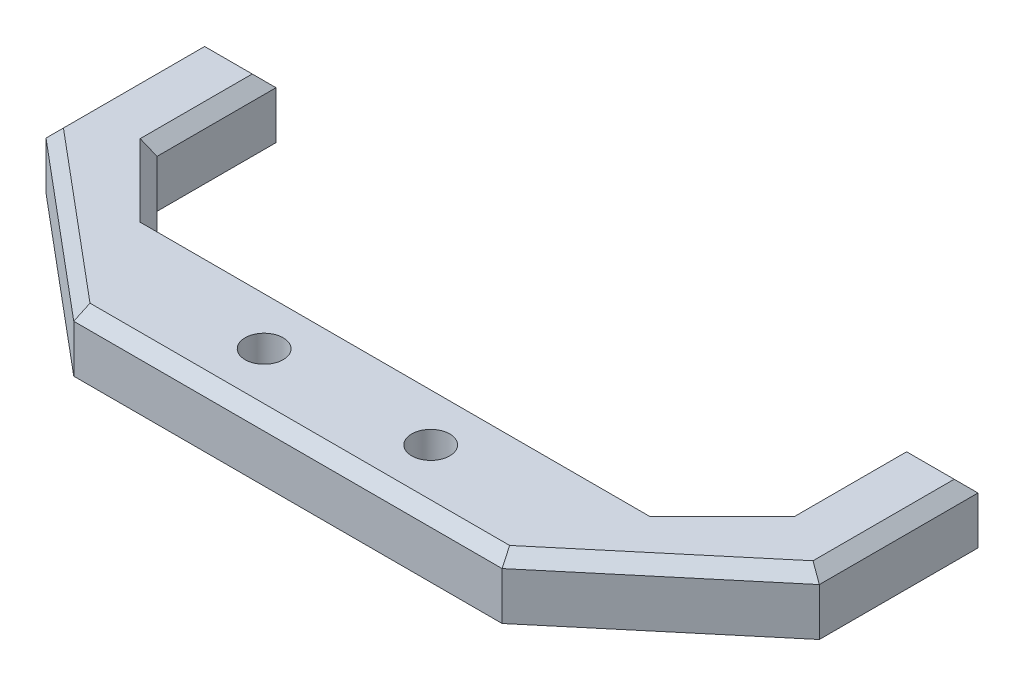
ISO-10303-21;
HEADER;
FILE_DESCRIPTION(('STEP AP214'),'2;1');
FILE_NAME('part.step','',(''),(''),'','','');
FILE_SCHEMA(('AUTOMOTIVE_DESIGN { 1 0 10303 214 1 1 1 1 }'));
ENDSEC;
DATA;
#1=APPLICATION_CONTEXT('core data for automotive mechanical design processes');
#2=APPLICATION_PROTOCOL_DEFINITION('international standard','automotive_design',2000,#1);
#3=PRODUCT_CONTEXT('',#1,'mechanical');
#4=PRODUCT('Part','Part','',(#3));
#5=PRODUCT_RELATED_PRODUCT_CATEGORY('part','',(#4));
#6=PRODUCT_DEFINITION_FORMATION('','',#4);
#7=PRODUCT_DEFINITION_CONTEXT('part definition',#1,'design');
#8=PRODUCT_DEFINITION('design','',#6,#7);
#9=PRODUCT_DEFINITION_SHAPE('','',#8);
#10=(LENGTH_UNIT() NAMED_UNIT(*) SI_UNIT(.MILLI.,.METRE.));
#11=(NAMED_UNIT(*) PLANE_ANGLE_UNIT() SI_UNIT($,.RADIAN.));
#12=(NAMED_UNIT(*) SI_UNIT($,.STERADIAN.) SOLID_ANGLE_UNIT());
#13=UNCERTAINTY_MEASURE_WITH_UNIT(LENGTH_MEASURE(1.E-05),#10,'distance_accuracy_value','');
#14=(GEOMETRIC_REPRESENTATION_CONTEXT(3) GLOBAL_UNCERTAINTY_ASSIGNED_CONTEXT((#13)) GLOBAL_UNIT_ASSIGNED_CONTEXT((#10,
#11,#12)) REPRESENTATION_CONTEXT('',''));
#15=CARTESIAN_POINT('',(0.,0.,0.));
#16=DIRECTION('',(0.,0.,1.));
#17=DIRECTION('',(1.,0.,0.));
#18=AXIS2_PLACEMENT_3D('',#15,#16,#17);
#19=CARTESIAN_POINT('',(21.,5.,0.));
#20=DIRECTION('',(0.707106781186549,0.,0.707106781186546));
#21=DIRECTION('',(0.707106781186546,0.,-0.707106781186549));
#22=AXIS2_PLACEMENT_3D('',#19,#20,#21);
#23=PLANE('',#22);
#24=DIRECTION('',(0.,-1.,0.));
#25=VECTOR('',#24,1.);
#26=CARTESIAN_POINT('',(21.,5.,0.));
#27=LINE('',#26,#25);
#28=CARTESIAN_POINT('',(21.,4.,0.));
#29=VERTEX_POINT('',#28);
#30=CARTESIAN_POINT('',(21.,0.,0.));
#31=VERTEX_POINT('',#30);
#32=EDGE_CURVE('E162',#29,#31,#27,.T.);
#33=ORIENTED_EDGE('',*,*,#32,.F.);
#34=DIRECTION('',(0.707106781186546,0.,-0.707106781186549));
#35=VECTOR('',#34,1.);
#36=CARTESIAN_POINT('',(26.5,4.00000000000001,-5.5));
#37=LINE('',#36,#35);
#38=CARTESIAN_POINT('',(26.5,4.00000000000001,-5.5));
#39=VERTEX_POINT('',#38);
#40=EDGE_CURVE('E283',#29,#39,#37,.T.);
#41=ORIENTED_EDGE('',*,*,#40,.T.);
#42=DIRECTION('',(0.,-1.,0.));
#43=VECTOR('',#42,1.);
#44=CARTESIAN_POINT('',(26.5,5.,-5.5));
#45=LINE('',#44,#43);
#46=CARTESIAN_POINT('',(26.5,0.,-5.5));
#47=VERTEX_POINT('',#46);
#48=EDGE_CURVE('E186',#39,#47,#45,.T.);
#49=ORIENTED_EDGE('',*,*,#48,.T.);
#50=DIRECTION('',(-0.707106781186546,0.,0.707106781186549));
#51=VECTOR('',#50,1.);
#52=CARTESIAN_POINT('',(21.,0.,0.));
#53=LINE('',#52,#51);
#54=EDGE_CURVE('E180',#47,#31,#53,.T.);
#55=ORIENTED_EDGE('',*,*,#54,.T.);
#56=EDGE_LOOP('',(#33,#41,#49,#55));
#57=FACE_BOUND('',#56,.T.);
#58=ADVANCED_FACE('F36',(#57),#23,.F.);
#59=CARTESIAN_POINT('',(-21.,5.,0.));
#60=DIRECTION('',(0.,0.,1.));
#61=DIRECTION('',(1.,0.,0.));
#62=AXIS2_PLACEMENT_3D('',#59,#60,#61);
#63=PLANE('',#62);
#64=DIRECTION('',(0.,-1.,0.));
#65=VECTOR('',#64,1.);
#66=CARTESIAN_POINT('',(-21.,5.,0.));
#67=LINE('',#66,#65);
#68=CARTESIAN_POINT('',(-21.,4.,0.));
#69=VERTEX_POINT('',#68);
#70=CARTESIAN_POINT('',(-21.,0.,0.));
#71=VERTEX_POINT('',#70);
#72=EDGE_CURVE('E174',#69,#71,#67,.T.);
#73=ORIENTED_EDGE('',*,*,#72,.F.);
#74=DIRECTION('',(1.,0.,0.));
#75=VECTOR('',#74,1.);
#76=CARTESIAN_POINT('',(21.,4.,0.));
#77=LINE('',#76,#75);
#78=EDGE_CURVE('E169',#69,#29,#77,.T.);
#79=ORIENTED_EDGE('',*,*,#78,.T.);
#80=ORIENTED_EDGE('',*,*,#32,.T.);
#81=DIRECTION('',(-1.,0.,0.));
#82=VECTOR('',#81,1.);
#83=CARTESIAN_POINT('',(-21.,0.,0.));
#84=LINE('',#83,#82);
#85=EDGE_CURVE('E166',#31,#71,#84,.T.);
#86=ORIENTED_EDGE('',*,*,#85,.T.);
#87=EDGE_LOOP('',(#73,#79,#80,#86));
#88=FACE_BOUND('',#87,.T.);
#89=ADVANCED_FACE('F165',(#88),#63,.F.);
#90=CARTESIAN_POINT('',(-21.,5.,0.));
#91=DIRECTION('',(-0.707106781186549,0.,0.707106781186546));
#92=DIRECTION('',(0.707106781186546,0.,0.707106781186549));
#93=AXIS2_PLACEMENT_3D('',#90,#91,#92);
#94=PLANE('',#93);
#95=DIRECTION('',(0.,-1.,0.));
#96=VECTOR('',#95,1.);
#97=CARTESIAN_POINT('',(-26.5,5.,-5.49999999999999));
#98=LINE('',#97,#96);
#99=CARTESIAN_POINT('',(-26.5,4.,-5.49999999999999));
#100=VERTEX_POINT('',#99);
#101=CARTESIAN_POINT('',(-26.5,0.,-5.49999999999999));
#102=VERTEX_POINT('',#101);
#103=EDGE_CURVE('E241',#100,#102,#98,.T.);
#104=ORIENTED_EDGE('',*,*,#103,.F.);
#105=DIRECTION('',(0.707106781186546,0.,0.707106781186549));
#106=VECTOR('',#105,1.);
#107=CARTESIAN_POINT('',(-21.,4.,0.));
#108=LINE('',#107,#106);
#109=EDGE_CURVE('E286',#100,#69,#108,.T.);
#110=ORIENTED_EDGE('',*,*,#109,.T.);
#111=ORIENTED_EDGE('',*,*,#72,.T.);
#112=DIRECTION('',(-0.707106781186546,0.,-0.707106781186549));
#113=VECTOR('',#112,1.);
#114=CARTESIAN_POINT('',(-21.,0.,0.));
#115=LINE('',#114,#113);
#116=EDGE_CURVE('E183',#71,#102,#115,.T.);
#117=ORIENTED_EDGE('',*,*,#116,.T.);
#118=EDGE_LOOP('',(#104,#110,#111,#117));
#119=FACE_BOUND('',#118,.T.);
#120=ADVANCED_FACE('F361',(#119),#94,.F.);
#121=CARTESIAN_POINT('',(-26.5,5.,-5.49999999999999));
#122=DIRECTION('',(-1.,0.,0.));
#123=DIRECTION('',(0.,0.,1.));
#124=AXIS2_PLACEMENT_3D('',#121,#122,#123);
#125=PLANE('',#124);
#126=DIRECTION('',(0.,-1.,0.));
#127=VECTOR('',#126,1.);
#128=CARTESIAN_POINT('',(-26.5,5.,-15.5));
#129=LINE('',#128,#127);
#130=CARTESIAN_POINT('',(-26.5,4.,-15.5));
#131=VERTEX_POINT('',#130);
#132=CARTESIAN_POINT('',(-26.5,0.,-15.5));
#133=VERTEX_POINT('',#132);
#134=EDGE_CURVE('E239',#131,#133,#129,.T.);
#135=ORIENTED_EDGE('',*,*,#134,.F.);
#136=DIRECTION('',(0.,0.,1.));
#137=VECTOR('',#136,1.);
#138=CARTESIAN_POINT('',(-26.5,4.,-5.49999999999999));
#139=LINE('',#138,#137);
#140=EDGE_CURVE('E46',#131,#100,#139,.T.);
#141=ORIENTED_EDGE('',*,*,#140,.T.);
#142=ORIENTED_EDGE('',*,*,#103,.T.);
#143=DIRECTION('',(0.,0.,-1.));
#144=VECTOR('',#143,1.);
#145=CARTESIAN_POINT('',(-26.5,0.,-5.49999999999999));
#146=LINE('',#145,#144);
#147=EDGE_CURVE('E198',#102,#133,#146,.T.);
#148=ORIENTED_EDGE('',*,*,#147,.T.);
#149=EDGE_LOOP('',(#135,#141,#142,#148));
#150=FACE_BOUND('',#149,.T.);
#151=ADVANCED_FACE('F482',(#150),#125,.F.);
#152=CARTESIAN_POINT('',(-26.5,5.,-15.5));
#153=DIRECTION('',(0.,0.,1.));
#154=DIRECTION('',(1.,0.,0.));
#155=AXIS2_PLACEMENT_3D('',#152,#153,#154);
#156=PLANE('',#155);
#157=DIRECTION('',(0.,-1.,0.));
#158=VECTOR('',#157,1.);
#159=CARTESIAN_POINT('',(-32.5,5.,-15.5));
#160=LINE('',#159,#158);
#161=CARTESIAN_POINT('',(-32.5,4.,-15.5));
#162=VERTEX_POINT('',#161);
#163=CARTESIAN_POINT('',(-32.5,0.,-15.5));
#164=VERTEX_POINT('',#163);
#165=EDGE_CURVE('E237',#162,#164,#160,.T.);
#166=ORIENTED_EDGE('',*,*,#165,.F.);
#167=DIRECTION('',(1.,0.,0.));
#168=VECTOR('',#167,1.);
#169=CARTESIAN_POINT('',(-26.5,4.,-15.5));
#170=LINE('',#169,#168);
#171=EDGE_CURVE('E11',#162,#131,#170,.T.);
#172=ORIENTED_EDGE('',*,*,#171,.T.);
#173=ORIENTED_EDGE('',*,*,#134,.T.);
#174=DIRECTION('',(-1.,0.,0.));
#175=VECTOR('',#174,1.);
#176=CARTESIAN_POINT('',(-26.5,0.,-15.5));
#177=LINE('',#176,#175);
#178=EDGE_CURVE('E201',#133,#164,#177,.T.);
#179=ORIENTED_EDGE('',*,*,#178,.T.);
#180=EDGE_LOOP('',(#166,#172,#173,#179));
#181=FACE_BOUND('',#180,.T.);
#182=ADVANCED_FACE('F481',(#181),#156,.F.);
#183=CARTESIAN_POINT('',(-32.5,5.,-2.16694465207057));
#184=DIRECTION('',(1.,0.,0.));
#185=DIRECTION('',(0.,0.,-1.));
#186=AXIS2_PLACEMENT_3D('',#183,#184,#185);
#187=PLANE('',#186);
#188=DIRECTION('',(0.,-1.,0.));
#189=VECTOR('',#188,1.);
#190=CARTESIAN_POINT('',(-32.5,5.,-2.16694465207057));
#191=LINE('',#190,#189);
#192=CARTESIAN_POINT('',(-32.5,4.,-2.16694465207057));
#193=VERTEX_POINT('',#192);
#194=CARTESIAN_POINT('',(-32.5,0.,-2.16694465207057));
#195=VERTEX_POINT('',#194);
#196=EDGE_CURVE('E235',#193,#195,#191,.T.);
#197=ORIENTED_EDGE('',*,*,#196,.F.);
#198=DIRECTION('',(0.,0.,-1.));
#199=VECTOR('',#198,1.);
#200=CARTESIAN_POINT('',(-32.5,4.,-15.5));
#201=LINE('',#200,#199);
#202=EDGE_CURVE('E268',#193,#162,#201,.T.);
#203=ORIENTED_EDGE('',*,*,#202,.T.);
#204=ORIENTED_EDGE('',*,*,#165,.T.);
#205=DIRECTION('',(0.,0.,1.));
#206=VECTOR('',#205,1.);
#207=CARTESIAN_POINT('',(-32.5,0.,-2.16694465207057));
#208=LINE('',#207,#206);
#209=EDGE_CURVE('E204',#164,#195,#208,.T.);
#210=ORIENTED_EDGE('',*,*,#209,.T.);
#211=EDGE_LOOP('',(#197,#203,#204,#210));
#212=FACE_BOUND('',#211,.T.);
#213=ADVANCED_FACE('F479',(#212),#187,.F.);
#214=CARTESIAN_POINT('',(-32.5,5.,-2.16694465207057));
#215=DIRECTION('',(0.64278760968654,0.,-0.766044443118977));
#216=DIRECTION('',(-0.766044443118977,0.,-0.64278760968654));
#217=AXIS2_PLACEMENT_3D('',#214,#215,#216);
#218=PLANE('',#217);
#219=DIRECTION('',(0.,-1.,0.));
#220=VECTOR('',#219,1.);
#221=CARTESIAN_POINT('',(-18.,5.,10.));
#222=LINE('',#221,#220);
#223=CARTESIAN_POINT('',(-18.,4.,10.));
#224=VERTEX_POINT('',#223);
#225=CARTESIAN_POINT('',(-18.,0.,10.));
#226=VERTEX_POINT('',#225);
#227=EDGE_CURVE('E233',#224,#226,#222,.T.);
#228=ORIENTED_EDGE('',*,*,#227,.F.);
#229=DIRECTION('',(-0.766044443118977,0.,-0.64278760968654));
#230=VECTOR('',#229,1.);
#231=CARTESIAN_POINT('',(-32.5,4.,-2.16694465207057));
#232=LINE('',#231,#230);
#233=EDGE_CURVE('E271',#224,#193,#232,.T.);
#234=ORIENTED_EDGE('',*,*,#233,.T.);
#235=ORIENTED_EDGE('',*,*,#196,.T.);
#236=DIRECTION('',(0.766044443118977,0.,0.64278760968654));
#237=VECTOR('',#236,1.);
#238=CARTESIAN_POINT('',(-32.5,0.,-2.16694465207057));
#239=LINE('',#238,#237);
#240=EDGE_CURVE('E207',#195,#226,#239,.T.);
#241=ORIENTED_EDGE('',*,*,#240,.T.);
#242=EDGE_LOOP('',(#228,#234,#235,#241));
#243=FACE_BOUND('',#242,.T.);
#244=ADVANCED_FACE('F474',(#243),#218,.F.);
#245=CARTESIAN_POINT('',(18.,5.,10.));
#246=DIRECTION('',(0.,0.,-1.));
#247=DIRECTION('',(-1.,0.,0.));
#248=AXIS2_PLACEMENT_3D('',#245,#246,#247);
#249=PLANE('',#248);
#250=DIRECTION('',(0.,-1.,0.));
#251=VECTOR('',#250,1.);
#252=CARTESIAN_POINT('',(18.,5.,10.));
#253=LINE('',#252,#251);
#254=CARTESIAN_POINT('',(18.,4.,10.));
#255=VERTEX_POINT('',#254);
#256=CARTESIAN_POINT('',(18.,0.,10.));
#257=VERTEX_POINT('',#256);
#258=EDGE_CURVE('E231',#255,#257,#253,.T.);
#259=ORIENTED_EDGE('',*,*,#258,.F.);
#260=DIRECTION('',(-1.,0.,0.));
#261=VECTOR('',#260,1.);
#262=CARTESIAN_POINT('',(-18.,4.,10.));
#263=LINE('',#262,#261);
#264=EDGE_CURVE('E273',#255,#224,#263,.T.);
#265=ORIENTED_EDGE('',*,*,#264,.T.);
#266=ORIENTED_EDGE('',*,*,#227,.T.);
#267=DIRECTION('',(1.,0.,0.));
#268=VECTOR('',#267,1.);
#269=CARTESIAN_POINT('',(18.,0.,10.));
#270=LINE('',#269,#268);
#271=EDGE_CURVE('E210',#226,#257,#270,.T.);
#272=ORIENTED_EDGE('',*,*,#271,.T.);
#273=EDGE_LOOP('',(#259,#265,#266,#272));
#274=FACE_BOUND('',#273,.T.);
#275=ADVANCED_FACE('F469',(#274),#249,.F.);
#276=CARTESIAN_POINT('',(32.5,5.,-2.16694465207058));
#277=DIRECTION('',(-0.64278760968654,0.,-0.766044443118977));
#278=DIRECTION('',(-0.766044443118977,0.,0.64278760968654));
#279=AXIS2_PLACEMENT_3D('',#276,#277,#278);
#280=PLANE('',#279);
#281=DIRECTION('',(0.,-1.,0.));
#282=VECTOR('',#281,1.);
#283=CARTESIAN_POINT('',(32.5,5.,-2.16694465207058));
#284=LINE('',#283,#282);
#285=CARTESIAN_POINT('',(32.5,4.,-2.16694465207058));
#286=VERTEX_POINT('',#285);
#287=CARTESIAN_POINT('',(32.5,0.,-2.16694465207058));
#288=VERTEX_POINT('',#287);
#289=EDGE_CURVE('E229',#286,#288,#284,.T.);
#290=ORIENTED_EDGE('',*,*,#289,.F.);
#291=DIRECTION('',(-0.766044443118977,0.,0.64278760968654));
#292=VECTOR('',#291,1.);
#293=CARTESIAN_POINT('',(18.,4.,10.));
#294=LINE('',#293,#292);
#295=EDGE_CURVE('E275',#286,#255,#294,.T.);
#296=ORIENTED_EDGE('',*,*,#295,.T.);
#297=ORIENTED_EDGE('',*,*,#258,.T.);
#298=DIRECTION('',(0.766044443118977,0.,-0.64278760968654));
#299=VECTOR('',#298,1.);
#300=CARTESIAN_POINT('',(32.5,0.,-2.16694465207058));
#301=LINE('',#300,#299);
#302=EDGE_CURVE('E213',#257,#288,#301,.T.);
#303=ORIENTED_EDGE('',*,*,#302,.T.);
#304=EDGE_LOOP('',(#290,#296,#297,#303));
#305=FACE_BOUND('',#304,.T.);
#306=ADVANCED_FACE('F463',(#305),#280,.F.);
#307=CARTESIAN_POINT('',(32.5,5.,-2.16694465207058));
#308=DIRECTION('',(-1.,0.,0.));
#309=DIRECTION('',(0.,0.,1.));
#310=AXIS2_PLACEMENT_3D('',#307,#308,#309);
#311=PLANE('',#310);
#312=DIRECTION('',(0.,-1.,0.));
#313=VECTOR('',#312,1.);
#314=CARTESIAN_POINT('',(32.5,5.,-15.5));
#315=LINE('',#314,#313);
#316=CARTESIAN_POINT('',(32.5,4.,-15.5));
#317=VERTEX_POINT('',#316);
#318=CARTESIAN_POINT('',(32.5,0.,-15.5));
#319=VERTEX_POINT('',#318);
#320=EDGE_CURVE('E227',#317,#319,#315,.T.);
#321=ORIENTED_EDGE('',*,*,#320,.F.);
#322=DIRECTION('',(0.,0.,1.));
#323=VECTOR('',#322,1.);
#324=CARTESIAN_POINT('',(32.5,4.,-2.16694465207058));
#325=LINE('',#324,#323);
#326=EDGE_CURVE('E277',#317,#286,#325,.T.);
#327=ORIENTED_EDGE('',*,*,#326,.T.);
#328=ORIENTED_EDGE('',*,*,#289,.T.);
#329=DIRECTION('',(0.,0.,-1.));
#330=VECTOR('',#329,1.);
#331=CARTESIAN_POINT('',(32.5,0.,-2.16694465207058));
#332=LINE('',#331,#330);
#333=EDGE_CURVE('E216',#288,#319,#332,.T.);
#334=ORIENTED_EDGE('',*,*,#333,.T.);
#335=EDGE_LOOP('',(#321,#327,#328,#334));
#336=FACE_BOUND('',#335,.T.);
#337=ADVANCED_FACE('F455',(#336),#311,.F.);
#338=CARTESIAN_POINT('',(26.5,5.,-15.5));
#339=DIRECTION('',(0.,0.,1.));
#340=DIRECTION('',(1.,0.,0.));
#341=AXIS2_PLACEMENT_3D('',#338,#339,#340);
#342=PLANE('',#341);
#343=DIRECTION('',(0.,-1.,0.));
#344=VECTOR('',#343,1.);
#345=CARTESIAN_POINT('',(26.5,5.,-15.5));
#346=LINE('',#345,#344);
#347=CARTESIAN_POINT('',(26.5,4.,-15.5));
#348=VERTEX_POINT('',#347);
#349=CARTESIAN_POINT('',(26.5,0.,-15.5));
#350=VERTEX_POINT('',#349);
#351=EDGE_CURVE('E225',#348,#350,#346,.T.);
#352=ORIENTED_EDGE('',*,*,#351,.F.);
#353=DIRECTION('',(1.,0.,0.));
#354=VECTOR('',#353,1.);
#355=CARTESIAN_POINT('',(32.5,4.,-15.5));
#356=LINE('',#355,#354);
#357=EDGE_CURVE('E279',#348,#317,#356,.T.);
#358=ORIENTED_EDGE('',*,*,#357,.T.);
#359=ORIENTED_EDGE('',*,*,#320,.T.);
#360=DIRECTION('',(-1.,0.,0.));
#361=VECTOR('',#360,1.);
#362=CARTESIAN_POINT('',(26.5,0.,-15.5));
#363=LINE('',#362,#361);
#364=EDGE_CURVE('E219',#319,#350,#363,.T.);
#365=ORIENTED_EDGE('',*,*,#364,.T.);
#366=EDGE_LOOP('',(#352,#358,#359,#365));
#367=FACE_BOUND('',#366,.T.);
#368=ADVANCED_FACE('F352',(#367),#342,.F.);
#369=CARTESIAN_POINT('',(26.5,5.,-5.5));
#370=DIRECTION('',(1.,0.,0.));
#371=DIRECTION('',(0.,0.,-1.));
#372=AXIS2_PLACEMENT_3D('',#369,#370,#371);
#373=PLANE('',#372);
#374=ORIENTED_EDGE('',*,*,#48,.F.);
#375=DIRECTION('',(0.,0.,-1.));
#376=VECTOR('',#375,1.);
#377=CARTESIAN_POINT('',(26.5,4.,-15.5));
#378=LINE('',#377,#376);
#379=EDGE_CURVE('E281',#39,#348,#378,.T.);
#380=ORIENTED_EDGE('',*,*,#379,.T.);
#381=ORIENTED_EDGE('',*,*,#351,.T.);
#382=DIRECTION('',(0.,0.,1.));
#383=VECTOR('',#382,1.);
#384=CARTESIAN_POINT('',(26.5,0.,-5.5));
#385=LINE('',#384,#383);
#386=EDGE_CURVE('E222',#350,#47,#385,.T.);
#387=ORIENTED_EDGE('',*,*,#386,.T.);
#388=EDGE_LOOP('',(#374,#380,#381,#387));
#389=FACE_BOUND('',#388,.T.);
#390=ADVANCED_FACE('F342',(#389),#373,.F.);
#391=CARTESIAN_POINT('',(0.,5.,0.));
#392=DIRECTION('',(0.,1.,0.));
#393=DIRECTION('',(0.,0.,1.));
#394=AXIS2_PLACEMENT_3D('',#391,#392,#393);
#395=PLANE('',#394);
#396=DIRECTION('',(-1.,0.,0.));
#397=VECTOR('',#396,1.);
#398=CARTESIAN_POINT('',(-32.5,5.,-14.5));
#399=LINE('',#398,#397);
#400=CARTESIAN_POINT('',(-27.5,5.,-14.5));
#401=VERTEX_POINT('',#400);
#402=CARTESIAN_POINT('',(-31.5,5.,-14.5));
#403=VERTEX_POINT('',#402);
#404=EDGE_CURVE('E173',#401,#403,#399,.T.);
#405=ORIENTED_EDGE('',*,*,#404,.T.);
#406=DIRECTION('',(0.,0.,1.));
#407=VECTOR('',#406,1.);
#408=CARTESIAN_POINT('',(-31.5,5.,-2.16694465207057));
#409=LINE('',#408,#407);
#410=CARTESIAN_POINT('',(-31.5,5.,-2.63325231022556));
#411=VERTEX_POINT('',#410);
#412=EDGE_CURVE('E265',#403,#411,#409,.T.);
#413=ORIENTED_EDGE('',*,*,#412,.T.);
#414=DIRECTION('',(0.766044443118977,0.,0.64278760968654));
#415=VECTOR('',#414,1.);
#416=CARTESIAN_POINT('',(-17.3572123903135,5.,9.23395555688104));
#417=LINE('',#416,#415);
#418=CARTESIAN_POINT('',(-17.6360297657338,5.,9.00000000000001));
#419=VERTEX_POINT('',#418);
#420=EDGE_CURVE('E263',#411,#419,#417,.T.);
#421=ORIENTED_EDGE('',*,*,#420,.T.);
#422=DIRECTION('',(1.,0.,0.));
#423=VECTOR('',#422,1.);
#424=CARTESIAN_POINT('',(18.,5.,9.00000000000001));
#425=LINE('',#424,#423);
#426=CARTESIAN_POINT('',(17.6360297657338,5.,9.00000000000001));
#427=VERTEX_POINT('',#426);
#428=EDGE_CURVE('E261',#419,#427,#425,.T.);
#429=ORIENTED_EDGE('',*,*,#428,.T.);
#430=DIRECTION('',(0.766044443118977,0.,-0.64278760968654));
#431=VECTOR('',#430,1.);
#432=CARTESIAN_POINT('',(31.8572123903134,5.,-2.93298909518955));
#433=LINE('',#432,#431);
#434=CARTESIAN_POINT('',(31.5,5.,-2.63325231022557));
#435=VERTEX_POINT('',#434);
#436=EDGE_CURVE('E259',#427,#435,#433,.T.);
#437=ORIENTED_EDGE('',*,*,#436,.T.);
#438=DIRECTION('',(0.,0.,-1.));
#439=VECTOR('',#438,1.);
#440=CARTESIAN_POINT('',(31.5,5.,-15.5));
#441=LINE('',#440,#439);
#442=CARTESIAN_POINT('',(31.5,5.,-14.5));
#443=VERTEX_POINT('',#442);
#444=EDGE_CURVE('E257',#435,#443,#441,.T.);
#445=ORIENTED_EDGE('',*,*,#444,.T.);
#446=DIRECTION('',(-1.,0.,0.));
#447=VECTOR('',#446,1.);
#448=CARTESIAN_POINT('',(26.5,5.,-14.5));
#449=LINE('',#448,#447);
#450=CARTESIAN_POINT('',(27.5,5.,-14.5));
#451=VERTEX_POINT('',#450);
#452=EDGE_CURVE('E255',#443,#451,#449,.T.);
#453=ORIENTED_EDGE('',*,*,#452,.T.);
#454=DIRECTION('',(0.,0.,1.));
#455=VECTOR('',#454,1.);
#456=CARTESIAN_POINT('',(27.5,5.,-5.5));
#457=LINE('',#456,#455);
#458=CARTESIAN_POINT('',(27.5,5.,-5.08578643762691));
#459=VERTEX_POINT('',#458);
#460=EDGE_CURVE('E253',#451,#459,#457,.T.);
#461=ORIENTED_EDGE('',*,*,#460,.T.);
#462=DIRECTION('',(-0.707106781186546,0.,0.707106781186549));
#463=VECTOR('',#462,1.);
#464=CARTESIAN_POINT('',(21.7071067811865,5.,0.707106781186536));
#465=LINE('',#464,#463);
#466=CARTESIAN_POINT('',(21.4142135623731,5.,0.999999999999989));
#467=VERTEX_POINT('',#466);
#468=EDGE_CURVE('E251',#459,#467,#465,.T.);
#469=ORIENTED_EDGE('',*,*,#468,.T.);
#470=DIRECTION('',(-1.,0.,0.));
#471=VECTOR('',#470,1.);
#472=CARTESIAN_POINT('',(-21.,5.,0.999999999999994));
#473=LINE('',#472,#471);
#474=CARTESIAN_POINT('',(-21.4142135623731,5.,0.999999999999995));
#475=VERTEX_POINT('',#474);
#476=EDGE_CURVE('E249',#467,#475,#473,.T.);
#477=ORIENTED_EDGE('',*,*,#476,.T.);
#478=DIRECTION('',(-0.707106781186546,0.,-0.707106781186549));
#479=VECTOR('',#478,1.);
#480=CARTESIAN_POINT('',(-27.2071067811865,5.,-4.79289321881346));
#481=LINE('',#480,#479);
#482=CARTESIAN_POINT('',(-27.5,5.,-5.08578643762691));
#483=VERTEX_POINT('',#482);
#484=EDGE_CURVE('E247',#475,#483,#481,.T.);
#485=ORIENTED_EDGE('',*,*,#484,.T.);
#486=DIRECTION('',(0.,0.,-1.));
#487=VECTOR('',#486,1.);
#488=CARTESIAN_POINT('',(-27.5,5.,-15.5));
#489=LINE('',#488,#487);
#490=EDGE_CURVE('E245',#483,#401,#489,.T.);
#491=ORIENTED_EDGE('',*,*,#490,.T.);
#492=EDGE_LOOP('',(#405,#413,#421,#429,#437,#445,#453,#461,#469,#477,#485,#491));
#493=FACE_BOUND('',#492,.T.);
#494=CARTESIAN_POINT('',(-7.,5.,5.));
#495=DIRECTION('',(0.,1.,0.));
#496=DIRECTION('',(0.,0.,1.));
#497=AXIS2_PLACEMENT_3D('',#494,#495,#496);
#498=CIRCLE('',#497,1.6);
#499=CARTESIAN_POINT('',(-7.,5.,6.6));
#500=VERTEX_POINT('',#499);
#501=EDGE_CURVE('E191',#500,#500,#498,.T.);
#502=ORIENTED_EDGE('',*,*,#501,.F.);
#503=EDGE_LOOP('',(#502));
#504=FACE_BOUND('',#503,.T.);
#505=CARTESIAN_POINT('',(7.,5.,5.));
#506=DIRECTION('',(0.,1.,0.));
#507=DIRECTION('',(0.,0.,-1.));
#508=AXIS2_PLACEMENT_3D('',#505,#506,#507);
#509=CIRCLE('',#508,1.6);
#510=CARTESIAN_POINT('',(7.,5.,3.4));
#511=VERTEX_POINT('',#510);
#512=EDGE_CURVE('E194',#511,#511,#509,.T.);
#513=ORIENTED_EDGE('',*,*,#512,.F.);
#514=EDGE_LOOP('',(#513));
#515=FACE_BOUND('',#514,.T.);
#516=ADVANCED_FACE('F339',(#493,#504,#515),#395,.T.);
#517=CARTESIAN_POINT('',(0.,0.,0.));
#518=DIRECTION('',(0.,1.,0.));
#519=DIRECTION('',(0.,0.,1.));
#520=AXIS2_PLACEMENT_3D('',#517,#518,#519);
#521=PLANE('',#520);
#522=CARTESIAN_POINT('',(-7.,0.,5.));
#523=DIRECTION('',(0.,1.,0.));
#524=DIRECTION('',(0.,0.,1.));
#525=AXIS2_PLACEMENT_3D('',#522,#523,#524);
#526=CIRCLE('',#525,1.6);
#527=CARTESIAN_POINT('',(-7.,0.,6.6));
#528=VERTEX_POINT('',#527);
#529=EDGE_CURVE('E188',#528,#528,#526,.T.);
#530=ORIENTED_EDGE('',*,*,#529,.T.);
#531=EDGE_LOOP('',(#530));
#532=FACE_BOUND('',#531,.T.);
#533=CARTESIAN_POINT('',(7.,0.,5.));
#534=DIRECTION('',(0.,1.,0.));
#535=DIRECTION('',(0.,0.,-1.));
#536=AXIS2_PLACEMENT_3D('',#533,#534,#535);
#537=CIRCLE('',#536,1.6);
#538=CARTESIAN_POINT('',(7.,0.,3.4));
#539=VERTEX_POINT('',#538);
#540=EDGE_CURVE('E327',#539,#539,#537,.T.);
#541=ORIENTED_EDGE('',*,*,#540,.T.);
#542=EDGE_LOOP('',(#541));
#543=FACE_BOUND('',#542,.T.);
#544=ORIENTED_EDGE('',*,*,#54,.F.);
#545=ORIENTED_EDGE('',*,*,#386,.F.);
#546=ORIENTED_EDGE('',*,*,#364,.F.);
#547=ORIENTED_EDGE('',*,*,#333,.F.);
#548=ORIENTED_EDGE('',*,*,#302,.F.);
#549=ORIENTED_EDGE('',*,*,#271,.F.);
#550=ORIENTED_EDGE('',*,*,#240,.F.);
#551=ORIENTED_EDGE('',*,*,#209,.F.);
#552=ORIENTED_EDGE('',*,*,#178,.F.);
#553=ORIENTED_EDGE('',*,*,#147,.F.);
#554=ORIENTED_EDGE('',*,*,#116,.F.);
#555=ORIENTED_EDGE('',*,*,#85,.F.);
#556=EDGE_LOOP('',(#544,#545,#546,#547,#548,#549,#550,#551,#552,#553,#554,#555));
#557=FACE_BOUND('',#556,.T.);
#558=ADVANCED_FACE('F178',(#532,#543,#557),#521,.F.);
#559=CARTESIAN_POINT('',(7.,0.,5.));
#560=DIRECTION('',(0.,1.,0.));
#561=DIRECTION('',(0.,0.,1.));
#562=AXIS2_PLACEMENT_3D('',#559,#560,#561);
#563=CYLINDRICAL_SURFACE('',#562,1.6);
#564=ORIENTED_EDGE('',*,*,#540,.F.);
#565=EDGE_LOOP('',(#564));
#566=FACE_BOUND('',#565,.T.);
#567=ORIENTED_EDGE('',*,*,#512,.T.);
#568=EDGE_LOOP('',(#567));
#569=FACE_BOUND('',#568,.T.);
#570=ADVANCED_FACE('F349',(#566,#569),#563,.F.);
#571=CARTESIAN_POINT('',(-7.,0.,5.));
#572=DIRECTION('',(0.,1.,0.));
#573=DIRECTION('',(0.,0.,1.));
#574=AXIS2_PLACEMENT_3D('',#571,#572,#573);
#575=CYLINDRICAL_SURFACE('',#574,1.6);
#576=ORIENTED_EDGE('',*,*,#529,.F.);
#577=EDGE_LOOP('',(#576));
#578=FACE_BOUND('',#577,.T.);
#579=ORIENTED_EDGE('',*,*,#501,.T.);
#580=EDGE_LOOP('',(#579));
#581=FACE_BOUND('',#580,.T.);
#582=ADVANCED_FACE('F337',(#578,#581),#575,.F.);
#583=CARTESIAN_POINT('',(27.5,5.,0.));
#584=DIRECTION('',(-0.70710678118655,0.707106781186545,0.));
#585=DIRECTION('',(0.,0.,-1.));
#586=AXIS2_PLACEMENT_3D('',#583,#584,#585);
#587=PLANE('',#586);
#588=DIRECTION('',(-0.577350269189625,-0.577350269189629,-0.577350269189624));
#589=VECTOR('',#588,1.);
#590=CARTESIAN_POINT('',(32.3333333333333,9.83333333333334,-9.6666666666667));
#591=LINE('',#590,#589);
#592=EDGE_CURVE('E316',#348,#451,#591,.F.);
#593=ORIENTED_EDGE('',*,*,#592,.F.);
#594=ORIENTED_EDGE('',*,*,#379,.F.);
#595=DIRECTION('',(-0.678598344545845,-0.67859834454585,-0.281084637714819));
#596=VECTOR('',#595,1.);
#597=CARTESIAN_POINT('',(28.4700810605087,5.97008106050873,-4.68396570576292));
#598=LINE('',#597,#596);
#599=EDGE_CURVE('E41',#459,#39,#598,.T.);
#600=ORIENTED_EDGE('',*,*,#599,.F.);
#601=ORIENTED_EDGE('',*,*,#460,.F.);
#602=EDGE_LOOP('',(#593,#594,#600,#601));
#603=FACE_BOUND('',#602,.T.);
#604=ADVANCED_FACE('F39',(#603),#587,.T.);
#605=CARTESIAN_POINT('',(11.2071067811866,5.,11.2071067811865));
#606=DIRECTION('',(-0.500000000000003,0.707106781186545,-0.500000000000001));
#607=DIRECTION('',(0.707106781186546,0.,-0.707106781186549));
#608=AXIS2_PLACEMENT_3D('',#605,#606,#607);
#609=PLANE('',#608);
#610=ORIENTED_EDGE('',*,*,#599,.T.);
#611=ORIENTED_EDGE('',*,*,#40,.F.);
#612=DIRECTION('',(-0.281084637714821,-0.678598344545849,-0.678598344545845));
#613=VECTOR('',#612,1.);
#614=CARTESIAN_POINT('',(22.5547046005095,7.75338893203381,3.75338893203378));
#615=LINE('',#614,#613);
#616=EDGE_CURVE('E314',#467,#29,#615,.T.);
#617=ORIENTED_EDGE('',*,*,#616,.F.);
#618=ORIENTED_EDGE('',*,*,#468,.F.);
#619=EDGE_LOOP('',(#610,#611,#617,#618));
#620=FACE_BOUND('',#619,.T.);
#621=ADVANCED_FACE('F434',(#620),#609,.T.);
#622=CARTESIAN_POINT('',(0.,5.,-14.5));
#623=DIRECTION('',(0.,0.707106781186545,-0.70710678118655));
#624=DIRECTION('',(1.,0.,0.));
#625=AXIS2_PLACEMENT_3D('',#622,#623,#624);
#626=PLANE('',#625);
#627=ORIENTED_EDGE('',*,*,#592,.T.);
#628=ORIENTED_EDGE('',*,*,#452,.F.);
#629=DIRECTION('',(0.577350269189624,-0.577350269189628,-0.577350269189625));
#630=VECTOR('',#629,1.);
#631=CARTESIAN_POINT('',(21.,15.5,-4.00000000000005));
#632=LINE('',#631,#630);
#633=EDGE_CURVE('E311',#317,#443,#632,.F.);
#634=ORIENTED_EDGE('',*,*,#633,.F.);
#635=ORIENTED_EDGE('',*,*,#357,.F.);
#636=EDGE_LOOP('',(#627,#628,#634,#635));
#637=FACE_BOUND('',#636,.T.);
#638=ADVANCED_FACE('F428',(#637),#626,.T.);
#639=CARTESIAN_POINT('',(0.,5.,0.999999999999991));
#640=DIRECTION('',(0.,0.707106781186545,-0.70710678118655));
#641=DIRECTION('',(1.,0.,0.));
#642=AXIS2_PLACEMENT_3D('',#639,#640,#641);
#643=PLANE('',#642);
#644=ORIENTED_EDGE('',*,*,#616,.T.);
#645=ORIENTED_EDGE('',*,*,#78,.F.);
#646=DIRECTION('',(0.281084637714818,-0.67859834454585,-0.678598344545845));
#647=VECTOR('',#646,1.);
#648=CARTESIAN_POINT('',(-19.7223070949164,0.915376459999269,-3.08462354000071));
#649=LINE('',#648,#647);
#650=EDGE_CURVE('E308',#475,#69,#649,.T.);
#651=ORIENTED_EDGE('',*,*,#650,.F.);
#652=ORIENTED_EDGE('',*,*,#476,.F.);
#653=EDGE_LOOP('',(#644,#645,#651,#652));
#654=FACE_BOUND('',#653,.T.);
#655=ADVANCED_FACE('F421',(#654),#643,.T.);
#656=CARTESIAN_POINT('',(31.5,5.,0.));
#657=DIRECTION('',(0.70710678118655,0.707106781186545,0.));
#658=DIRECTION('',(0.,0.,1.));
#659=AXIS2_PLACEMENT_3D('',#656,#657,#658);
#660=PLANE('',#659);
#661=ORIENTED_EDGE('',*,*,#633,.T.);
#662=ORIENTED_EDGE('',*,*,#444,.F.);
#663=DIRECTION('',(0.671542934237816,-0.67154293423782,0.313145613014973));
#664=VECTOR('',#663,1.);
#665=CARTESIAN_POINT('',(32.0537485342858,4.44625146571417,-2.37503512799598));
#666=LINE('',#665,#664);
#667=EDGE_CURVE('E305',#286,#435,#666,.F.);
#668=ORIENTED_EDGE('',*,*,#667,.F.);
#669=ORIENTED_EDGE('',*,*,#326,.F.);
#670=EDGE_LOOP('',(#661,#662,#668,#669));
#671=FACE_BOUND('',#670,.T.);
#672=ADVANCED_FACE('F414',(#671),#660,.T.);
#673=CARTESIAN_POINT('',(-11.2071067811866,5.,11.2071067811865));
#674=DIRECTION('',(0.500000000000003,0.707106781186544,-0.500000000000001));
#675=DIRECTION('',(0.707106781186546,0.,0.707106781186549));
#676=AXIS2_PLACEMENT_3D('',#673,#674,#675);
#677=PLANE('',#676);
#678=ORIENTED_EDGE('',*,*,#650,.T.);
#679=ORIENTED_EDGE('',*,*,#109,.F.);
#680=DIRECTION('',(0.678598344545845,-0.67859834454585,-0.281084637714817));
#681=VECTOR('',#680,1.);
#682=CARTESIAN_POINT('',(-23.1049571322036,0.604957132203634,-6.90627280067927));
#683=LINE('',#682,#681);
#684=EDGE_CURVE('E302',#483,#100,#683,.T.);
#685=ORIENTED_EDGE('',*,*,#684,.F.);
#686=ORIENTED_EDGE('',*,*,#484,.F.);
#687=EDGE_LOOP('',(#678,#679,#685,#686));
#688=FACE_BOUND('',#687,.T.);
#689=ADVANCED_FACE('F407',(#688),#677,.T.);
#690=CARTESIAN_POINT('',(11.7184175563722,5.,13.9654662223255));
#691=DIRECTION('',(0.454519477672046,0.707106781186546,0.541675220419703));
#692=DIRECTION('',(-0.766044443118977,0.,0.64278760968654));
#693=AXIS2_PLACEMENT_3D('',#690,#691,#692);
#694=PLANE('',#693);
#695=ORIENTED_EDGE('',*,*,#667,.T.);
#696=ORIENTED_EDGE('',*,*,#436,.F.);
#697=DIRECTION('',(0.249243569363957,-0.684791078771738,0.684791078771733));
#698=VECTOR('',#697,1.);
#699=CARTESIAN_POINT('',(18.1159183946327,3.68151682824721,10.3184831717528));
#700=LINE('',#699,#698);
#701=EDGE_CURVE('E299',#255,#427,#700,.F.);
#702=ORIENTED_EDGE('',*,*,#701,.F.);
#703=ORIENTED_EDGE('',*,*,#295,.F.);
#704=EDGE_LOOP('',(#695,#696,#702,#703));
#705=FACE_BOUND('',#704,.T.);
#706=ADVANCED_FACE('F400',(#705),#694,.T.);
#707=CARTESIAN_POINT('',(-27.5,5.,0.));
#708=DIRECTION('',(0.70710678118655,0.707106781186545,0.));
#709=DIRECTION('',(0.,0.,1.));
#710=AXIS2_PLACEMENT_3D('',#707,#708,#709);
#711=PLANE('',#710);
#712=ORIENTED_EDGE('',*,*,#684,.T.);
#713=ORIENTED_EDGE('',*,*,#140,.F.);
#714=DIRECTION('',(0.577350269189624,-0.577350269189629,-0.577350269189624));
#715=VECTOR('',#714,1.);
#716=CARTESIAN_POINT('',(-18.3333333333334,-4.16666666666668,-23.6666666666666));
#717=LINE('',#716,#715);
#718=EDGE_CURVE('E296',#401,#131,#717,.T.);
#719=ORIENTED_EDGE('',*,*,#718,.F.);
#720=ORIENTED_EDGE('',*,*,#490,.F.);
#721=EDGE_LOOP('',(#712,#713,#719,#720));
#722=FACE_BOUND('',#721,.T.);
#723=ADVANCED_FACE('F393',(#722),#711,.T.);
#724=CARTESIAN_POINT('',(0.,5.,9.00000000000001));
#725=DIRECTION('',(0.,0.707106781186545,0.70710678118655));
#726=DIRECTION('',(-1.,0.,0.));
#727=AXIS2_PLACEMENT_3D('',#724,#725,#726);
#728=PLANE('',#727);
#729=ORIENTED_EDGE('',*,*,#701,.T.);
#730=ORIENTED_EDGE('',*,*,#428,.F.);
#731=DIRECTION('',(-0.249243569363953,-0.684791078771739,0.684791078771734));
#732=VECTOR('',#731,1.);
#733=CARTESIAN_POINT('',(-16.5404380308696,8.0101135524806,5.98988644751944));
#734=LINE('',#733,#732);
#735=EDGE_CURVE('E293',#224,#419,#734,.F.);
#736=ORIENTED_EDGE('',*,*,#735,.F.);
#737=ORIENTED_EDGE('',*,*,#264,.F.);
#738=EDGE_LOOP('',(#729,#730,#736,#737));
#739=FACE_BOUND('',#738,.T.);
#740=ADVANCED_FACE('F386',(#739),#728,.T.);
#741=CARTESIAN_POINT('',(0.,5.,-14.5));
#742=DIRECTION('',(0.,0.707106781186545,-0.70710678118655));
#743=DIRECTION('',(1.,0.,0.));
#744=AXIS2_PLACEMENT_3D('',#741,#742,#743);
#745=PLANE('',#744);
#746=ORIENTED_EDGE('',*,*,#718,.T.);
#747=ORIENTED_EDGE('',*,*,#171,.F.);
#748=DIRECTION('',(0.577350269189624,0.577350269189628,0.577350269189625));
#749=VECTOR('',#748,1.);
#750=CARTESIAN_POINT('',(-21.,15.5,-4.00000000000005));
#751=LINE('',#750,#749);
#752=EDGE_CURVE('E291',#403,#162,#751,.F.);
#753=ORIENTED_EDGE('',*,*,#752,.F.);
#754=ORIENTED_EDGE('',*,*,#404,.F.);
#755=EDGE_LOOP('',(#746,#747,#753,#754));
#756=FACE_BOUND('',#755,.T.);
#757=ADVANCED_FACE('F379',(#756),#745,.T.);
#758=CARTESIAN_POINT('',(-11.7184175563722,5.,13.9654662223255));
#759=DIRECTION('',(-0.454519477672046,0.707106781186544,0.541675220419704));
#760=DIRECTION('',(-0.766044443118977,0.,-0.64278760968654));
#761=AXIS2_PLACEMENT_3D('',#758,#759,#760);
#762=PLANE('',#761);
#763=ORIENTED_EDGE('',*,*,#735,.T.);
#764=ORIENTED_EDGE('',*,*,#420,.F.);
#765=DIRECTION('',(-0.671542934237816,-0.671542934237821,0.31314561301497));
#766=VECTOR('',#765,1.);
#767=CARTESIAN_POINT('',(-26.069658030288,10.4303419697121,-5.16546235710276));
#768=LINE('',#767,#766);
#769=EDGE_CURVE('E289',#193,#411,#768,.F.);
#770=ORIENTED_EDGE('',*,*,#769,.F.);
#771=ORIENTED_EDGE('',*,*,#233,.F.);
#772=EDGE_LOOP('',(#763,#764,#770,#771));
#773=FACE_BOUND('',#772,.T.);
#774=ADVANCED_FACE('F372',(#773),#762,.T.);
#775=CARTESIAN_POINT('',(-31.5,5.,0.));
#776=DIRECTION('',(-0.70710678118655,0.707106781186545,0.));
#777=DIRECTION('',(0.,0.,-1.));
#778=AXIS2_PLACEMENT_3D('',#775,#776,#777);
#779=PLANE('',#778);
#780=ORIENTED_EDGE('',*,*,#752,.T.);
#781=ORIENTED_EDGE('',*,*,#202,.F.);
#782=ORIENTED_EDGE('',*,*,#769,.T.);
#783=ORIENTED_EDGE('',*,*,#412,.F.);
#784=EDGE_LOOP('',(#780,#781,#782,#783));
#785=FACE_BOUND('',#784,.T.);
#786=ADVANCED_FACE('F366',(#785),#779,.T.);
#787=CLOSED_SHELL('',(#58,#89,#120,#151,#182,#213,#244,#275,#306,#337,#368,#390,#516,#558,#570,
#582,#604,#621,#638,#655,#672,#689,#706,#723,#740,#757,#774,#786));
#788=MANIFOLD_SOLID_BREP('B2',#787);
#789=ADVANCED_BREP_SHAPE_REPRESENTATION('',(#18,#788),#14);
#790=SHAPE_DEFINITION_REPRESENTATION(#9,#789);
ENDSEC;
END-ISO-10303-21;
